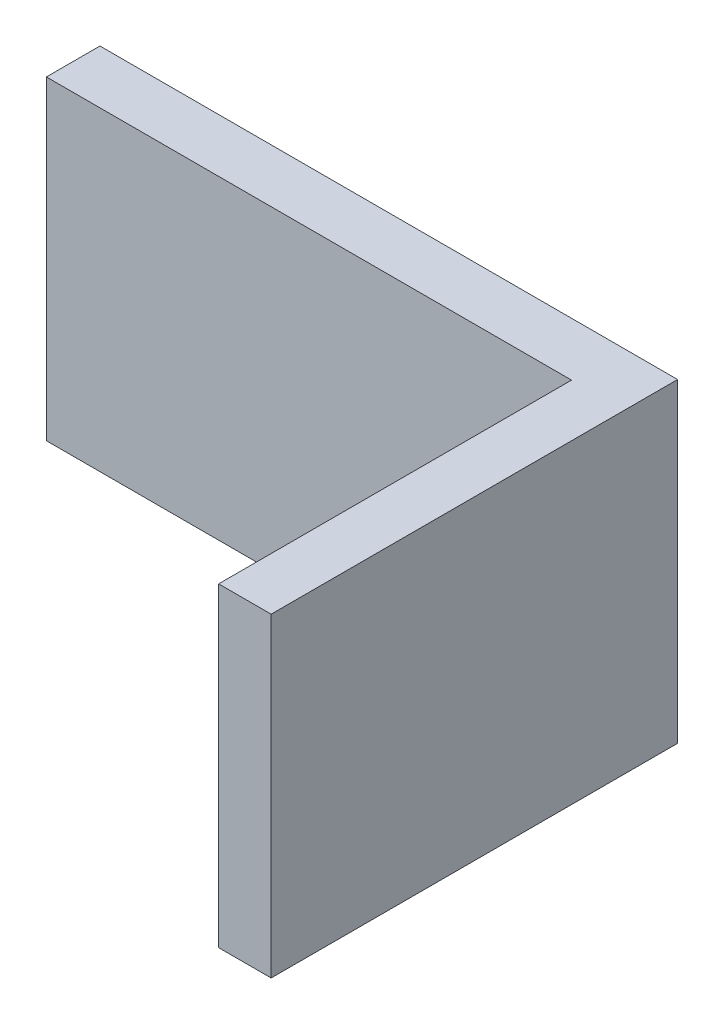
ISO-10303-21;
HEADER;
FILE_DESCRIPTION(('STEP AP214'),'2;1');
FILE_NAME('part.step','',(''),(''),'','','');
FILE_SCHEMA(('AUTOMOTIVE_DESIGN { 1 0 10303 214 1 1 1 1 }'));
ENDSEC;
DATA;
#1=APPLICATION_CONTEXT('core data for automotive mechanical design processes');
#2=APPLICATION_PROTOCOL_DEFINITION('international standard','automotive_design',2000,#1);
#3=PRODUCT_CONTEXT('',#1,'mechanical');
#4=PRODUCT('Part','Part','',(#3));
#5=PRODUCT_RELATED_PRODUCT_CATEGORY('part','',(#4));
#6=PRODUCT_DEFINITION_FORMATION('','',#4);
#7=PRODUCT_DEFINITION_CONTEXT('part definition',#1,'design');
#8=PRODUCT_DEFINITION('design','',#6,#7);
#9=PRODUCT_DEFINITION_SHAPE('','',#8);
#10=(LENGTH_UNIT() NAMED_UNIT(*) SI_UNIT(.MILLI.,.METRE.));
#11=(NAMED_UNIT(*) PLANE_ANGLE_UNIT() SI_UNIT($,.RADIAN.));
#12=(NAMED_UNIT(*) SI_UNIT($,.STERADIAN.) SOLID_ANGLE_UNIT());
#13=UNCERTAINTY_MEASURE_WITH_UNIT(LENGTH_MEASURE(1.E-05),#10,'distance_accuracy_value','');
#14=(GEOMETRIC_REPRESENTATION_CONTEXT(3) GLOBAL_UNCERTAINTY_ASSIGNED_CONTEXT((#13)) GLOBAL_UNIT_ASSIGNED_CONTEXT((#10,
#11,#12)) REPRESENTATION_CONTEXT('',''));
#15=CARTESIAN_POINT('',(0.,0.,0.));
#16=DIRECTION('',(0.,0.,1.));
#17=DIRECTION('',(1.,0.,0.));
#18=AXIS2_PLACEMENT_3D('',#15,#16,#17);
#19=CARTESIAN_POINT('',(4.55,-1.1,0.));
#20=DIRECTION('',(0.,1.,0.));
#21=DIRECTION('',(0.,0.,1.));
#22=AXIS2_PLACEMENT_3D('',#19,#20,#21);
#23=PLANE('',#22);
#24=DIRECTION('',(1.,0.,0.));
#25=VECTOR('',#24,1.);
#26=CARTESIAN_POINT('',(4.,-1.1,0.));
#27=LINE('',#26,#25);
#28=CARTESIAN_POINT('',(4.,-1.1,0.));
#29=VERTEX_POINT('',#28);
#30=CARTESIAN_POINT('',(4.55,-1.1,0.));
#31=VERTEX_POINT('',#30);
#32=EDGE_CURVE('E11',#29,#31,#27,.T.);
#33=ORIENTED_EDGE('',*,*,#32,.F.);
#34=DIRECTION('',(0.,0.,-1.));
#35=VECTOR('',#34,1.);
#36=CARTESIAN_POINT('',(4.,-1.1,0.051));
#37=LINE('',#36,#35);
#38=CARTESIAN_POINT('',(4.,-1.1,0.051));
#39=VERTEX_POINT('',#38);
#40=EDGE_CURVE('E24',#39,#29,#37,.T.);
#41=ORIENTED_EDGE('',*,*,#40,.F.);
#42=DIRECTION('',(-1.,0.,0.));
#43=VECTOR('',#42,1.);
#44=CARTESIAN_POINT('',(4.5,-1.1,0.051));
#45=LINE('',#44,#43);
#46=CARTESIAN_POINT('',(4.5,-1.1,0.051));
#47=VERTEX_POINT('',#46);
#48=EDGE_CURVE('E87',#47,#39,#45,.T.);
#49=ORIENTED_EDGE('',*,*,#48,.F.);
#50=DIRECTION('',(0.,0.,-1.));
#51=VECTOR('',#50,1.);
#52=CARTESIAN_POINT('',(4.5,-1.1,0.387));
#53=LINE('',#52,#51);
#54=CARTESIAN_POINT('',(4.5,-1.1,0.387));
#55=VERTEX_POINT('',#54);
#56=EDGE_CURVE('E114',#55,#47,#53,.T.);
#57=ORIENTED_EDGE('',*,*,#56,.F.);
#58=DIRECTION('',(-1.,0.,0.));
#59=VECTOR('',#58,1.);
#60=CARTESIAN_POINT('',(4.55,-1.1,0.387));
#61=LINE('',#60,#59);
#62=CARTESIAN_POINT('',(4.55,-1.1,0.387));
#63=VERTEX_POINT('',#62);
#64=EDGE_CURVE('E111',#63,#55,#61,.T.);
#65=ORIENTED_EDGE('',*,*,#64,.F.);
#66=DIRECTION('',(0.,0.,1.));
#67=VECTOR('',#66,1.);
#68=CARTESIAN_POINT('',(4.55,-1.1,0.));
#69=LINE('',#68,#67);
#70=EDGE_CURVE('E108',#31,#63,#69,.T.);
#71=ORIENTED_EDGE('',*,*,#70,.F.);
#72=EDGE_LOOP('',(#33,#41,#49,#57,#65,#71));
#73=FACE_BOUND('',#72,.T.);
#74=ADVANCED_FACE('F17',(#73),#23,.T.);
#75=CARTESIAN_POINT('',(4.,-1.4,0.));
#76=DIRECTION('',(0.,-1.,0.));
#77=DIRECTION('',(0.,0.,1.));
#78=AXIS2_PLACEMENT_3D('',#75,#76,#77);
#79=PLANE('',#78);
#80=DIRECTION('',(-1.,0.,0.));
#81=VECTOR('',#80,1.);
#82=CARTESIAN_POINT('',(4.55,-1.4,0.));
#83=LINE('',#82,#81);
#84=CARTESIAN_POINT('',(4.55,-1.4,0.));
#85=VERTEX_POINT('',#84);
#86=CARTESIAN_POINT('',(4.,-1.4,0.));
#87=VERTEX_POINT('',#86);
#88=EDGE_CURVE('E106',#85,#87,#83,.T.);
#89=ORIENTED_EDGE('',*,*,#88,.F.);
#90=DIRECTION('',(0.,0.,-1.));
#91=VECTOR('',#90,1.);
#92=CARTESIAN_POINT('',(4.55,-1.4,0.387));
#93=LINE('',#92,#91);
#94=CARTESIAN_POINT('',(4.55,-1.4,0.387));
#95=VERTEX_POINT('',#94);
#96=EDGE_CURVE('E103',#95,#85,#93,.T.);
#97=ORIENTED_EDGE('',*,*,#96,.F.);
#98=DIRECTION('',(1.,0.,0.));
#99=VECTOR('',#98,1.);
#100=CARTESIAN_POINT('',(4.5,-1.4,0.387));
#101=LINE('',#100,#99);
#102=CARTESIAN_POINT('',(4.5,-1.4,0.387));
#103=VERTEX_POINT('',#102);
#104=EDGE_CURVE('E100',#103,#95,#101,.T.);
#105=ORIENTED_EDGE('',*,*,#104,.F.);
#106=DIRECTION('',(0.,0.,1.));
#107=VECTOR('',#106,1.);
#108=CARTESIAN_POINT('',(4.5,-1.4,0.051));
#109=LINE('',#108,#107);
#110=CARTESIAN_POINT('',(4.5,-1.4,0.051));
#111=VERTEX_POINT('',#110);
#112=EDGE_CURVE('E72',#111,#103,#109,.T.);
#113=ORIENTED_EDGE('',*,*,#112,.F.);
#114=DIRECTION('',(1.,0.,0.));
#115=VECTOR('',#114,1.);
#116=CARTESIAN_POINT('',(4.,-1.4,0.051));
#117=LINE('',#116,#115);
#118=CARTESIAN_POINT('',(4.,-1.4,0.051));
#119=VERTEX_POINT('',#118);
#120=EDGE_CURVE('E66',#119,#111,#117,.T.);
#121=ORIENTED_EDGE('',*,*,#120,.F.);
#122=DIRECTION('',(0.,0.,1.));
#123=VECTOR('',#122,1.);
#124=CARTESIAN_POINT('',(4.,-1.4,0.));
#125=LINE('',#124,#123);
#126=EDGE_CURVE('E69',#87,#119,#125,.T.);
#127=ORIENTED_EDGE('',*,*,#126,.F.);
#128=EDGE_LOOP('',(#89,#97,#105,#113,#121,#127));
#129=FACE_BOUND('',#128,.T.);
#130=ADVANCED_FACE('F68',(#129),#79,.T.);
#131=CARTESIAN_POINT('',(4.55,-1.1,0.387));
#132=DIRECTION('',(0.,0.,1.));
#133=DIRECTION('',(0.,1.,0.));
#134=AXIS2_PLACEMENT_3D('',#131,#132,#133);
#135=PLANE('',#134);
#136=ORIENTED_EDGE('',*,*,#64,.T.);
#137=DIRECTION('',(0.,1.,0.));
#138=VECTOR('',#137,1.);
#139=CARTESIAN_POINT('',(4.5,-1.4,0.387));
#140=LINE('',#139,#138);
#141=EDGE_CURVE('E83',#103,#55,#140,.T.);
#142=ORIENTED_EDGE('',*,*,#141,.F.);
#143=ORIENTED_EDGE('',*,*,#104,.T.);
#144=DIRECTION('',(0.,-1.,0.));
#145=VECTOR('',#144,1.);
#146=CARTESIAN_POINT('',(4.55,-1.1,0.387));
#147=LINE('',#146,#145);
#148=EDGE_CURVE('E88',#63,#95,#147,.T.);
#149=ORIENTED_EDGE('',*,*,#148,.F.);
#150=EDGE_LOOP('',(#136,#142,#143,#149));
#151=FACE_BOUND('',#150,.T.);
#152=ADVANCED_FACE('F125',(#151),#135,.T.);
#153=CARTESIAN_POINT('',(4.5,-1.1,0.051));
#154=DIRECTION('',(0.,0.,1.));
#155=DIRECTION('',(0.,1.,0.));
#156=AXIS2_PLACEMENT_3D('',#153,#154,#155);
#157=PLANE('',#156);
#158=ORIENTED_EDGE('',*,*,#48,.T.);
#159=DIRECTION('',(0.,1.,0.));
#160=VECTOR('',#159,1.);
#161=CARTESIAN_POINT('',(4.,-1.4,0.051));
#162=LINE('',#161,#160);
#163=EDGE_CURVE('E81',#119,#39,#162,.T.);
#164=ORIENTED_EDGE('',*,*,#163,.F.);
#165=ORIENTED_EDGE('',*,*,#120,.T.);
#166=DIRECTION('',(0.,-1.,0.));
#167=VECTOR('',#166,1.);
#168=CARTESIAN_POINT('',(4.5,-1.1,0.051));
#169=LINE('',#168,#167);
#170=EDGE_CURVE('E89',#47,#111,#169,.T.);
#171=ORIENTED_EDGE('',*,*,#170,.F.);
#172=EDGE_LOOP('',(#158,#164,#165,#171));
#173=FACE_BOUND('',#172,.T.);
#174=ADVANCED_FACE('F86',(#173),#157,.T.);
#175=CARTESIAN_POINT('',(4.55,-1.4,0.));
#176=DIRECTION('',(1.,0.,0.));
#177=DIRECTION('',(0.,0.,1.));
#178=AXIS2_PLACEMENT_3D('',#175,#176,#177);
#179=PLANE('',#178);
#180=DIRECTION('',(0.,-1.,0.));
#181=VECTOR('',#180,1.);
#182=CARTESIAN_POINT('',(4.55,-1.1,0.));
#183=LINE('',#182,#181);
#184=EDGE_CURVE('E93',#31,#85,#183,.T.);
#185=ORIENTED_EDGE('',*,*,#184,.F.);
#186=ORIENTED_EDGE('',*,*,#70,.T.);
#187=ORIENTED_EDGE('',*,*,#148,.T.);
#188=ORIENTED_EDGE('',*,*,#96,.T.);
#189=EDGE_LOOP('',(#185,#186,#187,#188));
#190=FACE_BOUND('',#189,.T.);
#191=ADVANCED_FACE('F121',(#190),#179,.T.);
#192=CARTESIAN_POINT('',(4.,-1.1,0.));
#193=DIRECTION('',(-1.,0.,0.));
#194=DIRECTION('',(0.,0.,1.));
#195=AXIS2_PLACEMENT_3D('',#192,#193,#194);
#196=PLANE('',#195);
#197=DIRECTION('',(0.,1.,0.));
#198=VECTOR('',#197,1.);
#199=CARTESIAN_POINT('',(4.,-1.4,0.));
#200=LINE('',#199,#198);
#201=EDGE_CURVE('E82',#87,#29,#200,.T.);
#202=ORIENTED_EDGE('',*,*,#201,.F.);
#203=ORIENTED_EDGE('',*,*,#126,.T.);
#204=ORIENTED_EDGE('',*,*,#163,.T.);
#205=ORIENTED_EDGE('',*,*,#40,.T.);
#206=EDGE_LOOP('',(#202,#203,#204,#205));
#207=FACE_BOUND('',#206,.T.);
#208=ADVANCED_FACE('F80',(#207),#196,.T.);
#209=CARTESIAN_POINT('',(4.5,-1.1,0.051));
#210=DIRECTION('',(-1.,0.,0.));
#211=DIRECTION('',(0.,0.,1.));
#212=AXIS2_PLACEMENT_3D('',#209,#210,#211);
#213=PLANE('',#212);
#214=ORIENTED_EDGE('',*,*,#170,.T.);
#215=ORIENTED_EDGE('',*,*,#112,.T.);
#216=ORIENTED_EDGE('',*,*,#141,.T.);
#217=ORIENTED_EDGE('',*,*,#56,.T.);
#218=EDGE_LOOP('',(#214,#215,#216,#217));
#219=FACE_BOUND('',#218,.T.);
#220=ADVANCED_FACE('F127',(#219),#213,.T.);
#221=CARTESIAN_POINT('',(4.55,-1.4,0.));
#222=DIRECTION('',(0.,0.,-1.));
#223=DIRECTION('',(0.,1.,0.));
#224=AXIS2_PLACEMENT_3D('',#221,#222,#223);
#225=PLANE('',#224);
#226=ORIENTED_EDGE('',*,*,#88,.T.);
#227=ORIENTED_EDGE('',*,*,#201,.T.);
#228=ORIENTED_EDGE('',*,*,#32,.T.);
#229=ORIENTED_EDGE('',*,*,#184,.T.);
#230=EDGE_LOOP('',(#226,#227,#228,#229));
#231=FACE_BOUND('',#230,.T.);
#232=ADVANCED_FACE('F117',(#231),#225,.T.);
#233=CLOSED_SHELL('',(#74,#130,#152,#174,#191,#208,#220,#232));
#234=MANIFOLD_SOLID_BREP('B1',#233);
#235=ADVANCED_BREP_SHAPE_REPRESENTATION('',(#18,#234),#14);
#236=SHAPE_DEFINITION_REPRESENTATION(#9,#235);
ENDSEC;
END-ISO-10303-21;
